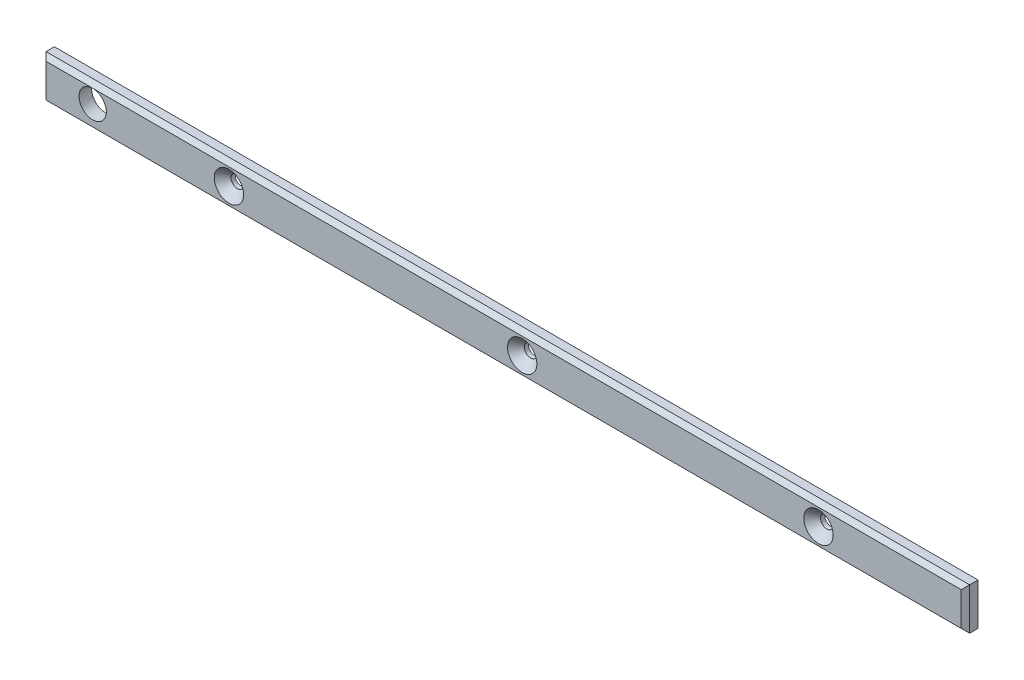
ISO-10303-21;
HEADER;
FILE_DESCRIPTION(('STEP AP214'),'2;1');
FILE_NAME('part.step','',(''),(''),'','','');
FILE_SCHEMA(('AUTOMOTIVE_DESIGN { 1 0 10303 214 1 1 1 1 }'));
ENDSEC;
DATA;
#1=APPLICATION_CONTEXT('core data for automotive mechanical design processes');
#2=APPLICATION_PROTOCOL_DEFINITION('international standard','automotive_design',2000,#1);
#3=PRODUCT_CONTEXT('',#1,'mechanical');
#4=PRODUCT('Part','Part','',(#3));
#5=PRODUCT_RELATED_PRODUCT_CATEGORY('part','',(#4));
#6=PRODUCT_DEFINITION_FORMATION('','',#4);
#7=PRODUCT_DEFINITION_CONTEXT('part definition',#1,'design');
#8=PRODUCT_DEFINITION('design','',#6,#7);
#9=PRODUCT_DEFINITION_SHAPE('','',#8);
#10=(LENGTH_UNIT() NAMED_UNIT(*) SI_UNIT(.MILLI.,.METRE.));
#11=(NAMED_UNIT(*) PLANE_ANGLE_UNIT() SI_UNIT($,.RADIAN.));
#12=(NAMED_UNIT(*) SI_UNIT($,.STERADIAN.) SOLID_ANGLE_UNIT());
#13=UNCERTAINTY_MEASURE_WITH_UNIT(LENGTH_MEASURE(1.E-05),#10,'distance_accuracy_value','');
#14=(GEOMETRIC_REPRESENTATION_CONTEXT(3) GLOBAL_UNCERTAINTY_ASSIGNED_CONTEXT((#13)) GLOBAL_UNIT_ASSIGNED_CONTEXT((#10,
#11,#12)) REPRESENTATION_CONTEXT('',''));
#15=CARTESIAN_POINT('',(0.,0.,0.));
#16=DIRECTION('',(0.,0.,1.));
#17=DIRECTION('',(1.,0.,0.));
#18=AXIS2_PLACEMENT_3D('',#15,#16,#17);
#19=CARTESIAN_POINT('',(-180.13682376559,-11.4814529840953,0.));
#20=DIRECTION('',(-1.,0.,0.));
#21=DIRECTION('',(0.,0.,1.));
#22=AXIS2_PLACEMENT_3D('',#19,#20,#21);
#23=PLANE('',#22);
#24=DIRECTION('',(0.,-1.,0.));
#25=VECTOR('',#24,1.);
#26=CARTESIAN_POINT('',(-180.13682376559,-11.4814529840953,2.));
#27=LINE('',#26,#25);
#28=CARTESIAN_POINT('',(-180.13682376559,-11.4814529840953,2.));
#29=VERTEX_POINT('',#28);
#30=CARTESIAN_POINT('',(-180.13682376559,-21.4814529840953,2.));
#31=VERTEX_POINT('',#30);
#32=EDGE_CURVE('E88',#29,#31,#27,.T.);
#33=ORIENTED_EDGE('',*,*,#32,.F.);
#34=DIRECTION('',(0.,0.,1.));
#35=VECTOR('',#34,1.);
#36=CARTESIAN_POINT('',(-180.13682376559,-11.4814529840953,0.));
#37=LINE('',#36,#35);
#38=CARTESIAN_POINT('',(-180.13682376559,-11.4814529840953,0.));
#39=VERTEX_POINT('',#38);
#40=EDGE_CURVE('E83',#39,#29,#37,.T.);
#41=ORIENTED_EDGE('',*,*,#40,.F.);
#42=DIRECTION('',(0.,-1.,0.));
#43=VECTOR('',#42,1.);
#44=CARTESIAN_POINT('',(-180.13682376559,-11.4814529840953,0.));
#45=LINE('',#44,#43);
#46=CARTESIAN_POINT('',(-180.13682376559,-21.4814529840953,0.));
#47=VERTEX_POINT('',#46);
#48=EDGE_CURVE('E85',#39,#47,#45,.T.);
#49=ORIENTED_EDGE('',*,*,#48,.T.);
#50=DIRECTION('',(0.,0.,1.));
#51=VECTOR('',#50,1.);
#52=CARTESIAN_POINT('',(-180.13682376559,-21.4814529840953,0.));
#53=LINE('',#52,#51);
#54=EDGE_CURVE('E11',#47,#31,#53,.T.);
#55=ORIENTED_EDGE('',*,*,#54,.T.);
#56=EDGE_LOOP('',(#33,#41,#49,#55));
#57=FACE_BOUND('',#56,.T.);
#58=ADVANCED_FACE('F17',(#57),#23,.T.);
#59=CARTESIAN_POINT('',(-180.13682376559,-21.4814529840953,0.));
#60=DIRECTION('',(0.,-1.,0.));
#61=DIRECTION('',(-1.,0.,0.));
#62=AXIS2_PLACEMENT_3D('',#59,#60,#61);
#63=PLANE('',#62);
#64=DIRECTION('',(1.,0.,0.));
#65=VECTOR('',#64,1.);
#66=CARTESIAN_POINT('',(-180.13682376559,-21.4814529840953,2.));
#67=LINE('',#66,#65);
#68=CARTESIAN_POINT('',(39.8631762344104,-21.4814529840953,2.));
#69=VERTEX_POINT('',#68);
#70=EDGE_CURVE('E148',#31,#69,#67,.T.);
#71=ORIENTED_EDGE('',*,*,#70,.F.);
#72=ORIENTED_EDGE('',*,*,#54,.F.);
#73=DIRECTION('',(1.,0.,0.));
#74=VECTOR('',#73,1.);
#75=CARTESIAN_POINT('',(-180.13682376559,-21.4814529840953,0.));
#76=LINE('',#75,#74);
#77=CARTESIAN_POINT('',(39.8631762344104,-21.4814529840953,0.));
#78=VERTEX_POINT('',#77);
#79=EDGE_CURVE('E100',#47,#78,#76,.T.);
#80=ORIENTED_EDGE('',*,*,#79,.T.);
#81=DIRECTION('',(0.,0.,1.));
#82=VECTOR('',#81,1.);
#83=CARTESIAN_POINT('',(39.8631762344104,-21.4814529840953,0.));
#84=LINE('',#83,#82);
#85=EDGE_CURVE('E25',#78,#69,#84,.T.);
#86=ORIENTED_EDGE('',*,*,#85,.T.);
#87=EDGE_LOOP('',(#71,#72,#80,#86));
#88=FACE_BOUND('',#87,.T.);
#89=ADVANCED_FACE('F211',(#88),#63,.T.);
#90=CARTESIAN_POINT('',(39.8631762344104,-21.4814529840953,0.));
#91=DIRECTION('',(1.,0.,0.));
#92=DIRECTION('',(0.,-1.,0.));
#93=AXIS2_PLACEMENT_3D('',#90,#91,#92);
#94=PLANE('',#93);
#95=DIRECTION('',(0.,1.,0.));
#96=VECTOR('',#95,1.);
#97=CARTESIAN_POINT('',(39.8631762344104,-21.4814529840953,2.));
#98=LINE('',#97,#96);
#99=CARTESIAN_POINT('',(39.8631762344104,-11.4814529840953,2.));
#100=VERTEX_POINT('',#99);
#101=EDGE_CURVE('E155',#69,#100,#98,.T.);
#102=ORIENTED_EDGE('',*,*,#101,.F.);
#103=ORIENTED_EDGE('',*,*,#85,.F.);
#104=DIRECTION('',(0.,1.,0.));
#105=VECTOR('',#104,1.);
#106=CARTESIAN_POINT('',(39.8631762344104,-21.4814529840953,0.));
#107=LINE('',#106,#105);
#108=CARTESIAN_POINT('',(39.8631762344104,-11.4814529840953,0.));
#109=VERTEX_POINT('',#108);
#110=EDGE_CURVE('E107',#78,#109,#107,.T.);
#111=ORIENTED_EDGE('',*,*,#110,.T.);
#112=DIRECTION('',(0.,0.,1.));
#113=VECTOR('',#112,1.);
#114=CARTESIAN_POINT('',(39.8631762344104,-11.4814529840953,0.));
#115=LINE('',#114,#113);
#116=EDGE_CURVE('E94',#109,#100,#115,.T.);
#117=ORIENTED_EDGE('',*,*,#116,.T.);
#118=EDGE_LOOP('',(#102,#103,#111,#117));
#119=FACE_BOUND('',#118,.T.);
#120=ADVANCED_FACE('F165',(#119),#94,.T.);
#121=CARTESIAN_POINT('',(39.8631762344104,-11.4814529840953,0.));
#122=DIRECTION('',(0.,1.,0.));
#123=DIRECTION('',(1.,0.,0.));
#124=AXIS2_PLACEMENT_3D('',#121,#122,#123);
#125=PLANE('',#124);
#126=DIRECTION('',(-1.,0.,0.));
#127=VECTOR('',#126,1.);
#128=CARTESIAN_POINT('',(39.8631762344104,-11.4814529840953,2.));
#129=LINE('',#128,#127);
#130=EDGE_CURVE('E133',#100,#29,#129,.T.);
#131=ORIENTED_EDGE('',*,*,#130,.F.);
#132=ORIENTED_EDGE('',*,*,#116,.F.);
#133=DIRECTION('',(-1.,0.,0.));
#134=VECTOR('',#133,1.);
#135=CARTESIAN_POINT('',(39.8631762344104,-11.4814529840953,0.));
#136=LINE('',#135,#134);
#137=EDGE_CURVE('E99',#109,#39,#136,.T.);
#138=ORIENTED_EDGE('',*,*,#137,.T.);
#139=ORIENTED_EDGE('',*,*,#40,.T.);
#140=EDGE_LOOP('',(#131,#132,#138,#139));
#141=FACE_BOUND('',#140,.T.);
#142=ADVANCED_FACE('F104',(#141),#125,.T.);
#143=CARTESIAN_POINT('',(39.8631762344104,-25.4814529840953,2.));
#144=DIRECTION('',(0.707106781186548,0.,0.707106781186548));
#145=DIRECTION('',(0.,-1.,0.));
#146=AXIS2_PLACEMENT_3D('',#143,#144,#145);
#147=PLANE('',#146);
#148=ORIENTED_EDGE('',*,*,#101,.T.);
#149=DIRECTION('',(-0.577350269189625,-0.577350269189625,0.577350269189628));
#150=VECTOR('',#149,1.);
#151=CARTESIAN_POINT('',(39.8631762344104,-11.4814529840953,2.));
#152=LINE('',#151,#150);
#153=CARTESIAN_POINT('',(38.8631762344104,-12.4814529840953,3.));
#154=VERTEX_POINT('',#153);
#155=EDGE_CURVE('E140',#100,#154,#152,.T.);
#156=ORIENTED_EDGE('',*,*,#155,.T.);
#157=DIRECTION('',(0.,1.,0.));
#158=VECTOR('',#157,1.);
#159=CARTESIAN_POINT('',(38.8631762344104,-20.4814529840953,3.));
#160=LINE('',#159,#158);
#161=CARTESIAN_POINT('',(38.8631762344104,-20.4814529840953,3.));
#162=VERTEX_POINT('',#161);
#163=EDGE_CURVE('E117',#162,#154,#160,.T.);
#164=ORIENTED_EDGE('',*,*,#163,.F.);
#165=DIRECTION('',(-0.577350269189625,0.577350269189629,0.577350269189623));
#166=VECTOR('',#165,1.);
#167=CARTESIAN_POINT('',(39.8631762344104,-21.4814529840953,2.));
#168=LINE('',#167,#166);
#169=EDGE_CURVE('E152',#69,#162,#168,.T.);
#170=ORIENTED_EDGE('',*,*,#169,.F.);
#171=EDGE_LOOP('',(#148,#156,#164,#170));
#172=FACE_BOUND('',#171,.T.);
#173=ADVANCED_FACE('F169',(#172),#147,.T.);
#174=CARTESIAN_POINT('',(-184.13682376559,-21.4814529840953,2.));
#175=DIRECTION('',(0.,-0.707106781186546,0.707106781186549));
#176=DIRECTION('',(-1.,0.,0.));
#177=AXIS2_PLACEMENT_3D('',#174,#175,#176);
#178=PLANE('',#177);
#179=ORIENTED_EDGE('',*,*,#70,.T.);
#180=ORIENTED_EDGE('',*,*,#169,.T.);
#181=DIRECTION('',(1.,0.,0.));
#182=VECTOR('',#181,1.);
#183=CARTESIAN_POINT('',(-179.13682376559,-20.4814529840953,3.));
#184=LINE('',#183,#182);
#185=CARTESIAN_POINT('',(-179.13682376559,-20.4814529840953,3.));
#186=VERTEX_POINT('',#185);
#187=EDGE_CURVE('E188',#186,#162,#184,.T.);
#188=ORIENTED_EDGE('',*,*,#187,.F.);
#189=DIRECTION('',(0.577350269189614,0.577350269189634,0.577350269189629));
#190=VECTOR('',#189,1.);
#191=CARTESIAN_POINT('',(-180.13682376559,-21.4814529840953,2.));
#192=LINE('',#191,#190);
#193=EDGE_CURVE('E145',#31,#186,#192,.T.);
#194=ORIENTED_EDGE('',*,*,#193,.F.);
#195=EDGE_LOOP('',(#179,#180,#188,#194));
#196=FACE_BOUND('',#195,.T.);
#197=ADVANCED_FACE('F214',(#196),#178,.T.);
#198=CARTESIAN_POINT('',(-180.13682376559,-7.48145298409528,2.));
#199=DIRECTION('',(-0.707106781186548,0.,0.707106781186548));
#200=DIRECTION('',(0.,1.,0.));
#201=AXIS2_PLACEMENT_3D('',#198,#199,#200);
#202=PLANE('',#201);
#203=ORIENTED_EDGE('',*,*,#32,.T.);
#204=ORIENTED_EDGE('',*,*,#193,.T.);
#205=DIRECTION('',(0.,-1.,0.));
#206=VECTOR('',#205,1.);
#207=CARTESIAN_POINT('',(-179.13682376559,-12.4814529840953,3.));
#208=LINE('',#207,#206);
#209=CARTESIAN_POINT('',(-179.13682376559,-12.4814529840953,3.));
#210=VERTEX_POINT('',#209);
#211=EDGE_CURVE('E181',#210,#186,#208,.T.);
#212=ORIENTED_EDGE('',*,*,#211,.F.);
#213=DIRECTION('',(0.577350269189626,-0.577350269189626,0.577350269189626));
#214=VECTOR('',#213,1.);
#215=CARTESIAN_POINT('',(-180.13682376559,-11.4814529840953,2.));
#216=LINE('',#215,#214);
#217=EDGE_CURVE('E137',#29,#210,#216,.T.);
#218=ORIENTED_EDGE('',*,*,#217,.F.);
#219=EDGE_LOOP('',(#203,#204,#212,#218));
#220=FACE_BOUND('',#219,.T.);
#221=ADVANCED_FACE('F216',(#220),#202,.T.);
#222=CARTESIAN_POINT('',(43.8631762344104,-11.4814529840953,2.));
#223=DIRECTION('',(0.,0.707106781186548,0.707106781186547));
#224=DIRECTION('',(1.,0.,0.));
#225=AXIS2_PLACEMENT_3D('',#222,#223,#224);
#226=PLANE('',#225);
#227=ORIENTED_EDGE('',*,*,#130,.T.);
#228=ORIENTED_EDGE('',*,*,#217,.T.);
#229=DIRECTION('',(-1.,0.,0.));
#230=VECTOR('',#229,1.);
#231=CARTESIAN_POINT('',(38.8631762344104,-12.4814529840953,3.));
#232=LINE('',#231,#230);
#233=EDGE_CURVE('E176',#154,#210,#232,.T.);
#234=ORIENTED_EDGE('',*,*,#233,.F.);
#235=ORIENTED_EDGE('',*,*,#155,.F.);
#236=EDGE_LOOP('',(#227,#228,#234,#235));
#237=FACE_BOUND('',#236,.T.);
#238=ADVANCED_FACE('F174',(#237),#226,.T.);
#239=CARTESIAN_POINT('',(-168.016835100665,-15.7589721414259,-3.5));
#240=DIRECTION('',(0.,0.,1.));
#241=DIRECTION('',(-1.,0.,0.));
#242=AXIS2_PLACEMENT_3D('',#239,#240,#241);
#243=CYLINDRICAL_SURFACE('',#242,3.25);
#244=CARTESIAN_POINT('',(-168.016835100665,-15.7589721414259,3.));
#245=DIRECTION('',(0.,0.,-1.));
#246=DIRECTION('',(-1.,0.,0.));
#247=AXIS2_PLACEMENT_3D('',#244,#245,#246);
#248=CIRCLE('',#247,3.25);
#249=CARTESIAN_POINT('',(-171.266835100665,-15.7589721414259,3.));
#250=VERTEX_POINT('',#249);
#251=EDGE_CURVE('E108',#250,#250,#248,.T.);
#252=ORIENTED_EDGE('',*,*,#251,.F.);
#253=EDGE_LOOP('',(#252));
#254=FACE_BOUND('',#253,.T.);
#255=CARTESIAN_POINT('',(-168.016835100665,-15.7589721414259,0.));
#256=DIRECTION('',(0.,0.,1.));
#257=DIRECTION('',(-1.,0.,0.));
#258=AXIS2_PLACEMENT_3D('',#255,#256,#257);
#259=CIRCLE('',#258,3.25);
#260=CARTESIAN_POINT('',(-171.266835100665,-15.7589721414259,0.));
#261=VERTEX_POINT('',#260);
#262=EDGE_CURVE('E102',#261,#261,#259,.T.);
#263=ORIENTED_EDGE('',*,*,#262,.F.);
#264=EDGE_LOOP('',(#263));
#265=FACE_BOUND('',#264,.T.);
#266=ADVANCED_FACE('F250',(#254,#265),#243,.F.);
#267=CARTESIAN_POINT('',(4.86317623441042,-16.4814529840953,-3.5));
#268=DIRECTION('',(0.,0.,1.));
#269=DIRECTION('',(-1.,0.,0.));
#270=AXIS2_PLACEMENT_3D('',#267,#268,#269);
#271=CYLINDRICAL_SURFACE('',#270,1.5);
#272=CARTESIAN_POINT('',(4.86317623441042,-16.4814529840953,1.));
#273=DIRECTION('',(0.,0.,-1.));
#274=DIRECTION('',(-1.,0.,0.));
#275=AXIS2_PLACEMENT_3D('',#272,#273,#274);
#276=CIRCLE('',#275,1.5);
#277=CARTESIAN_POINT('',(3.36317623441042,-16.4814529840953,1.));
#278=VERTEX_POINT('',#277);
#279=EDGE_CURVE('E481',#278,#278,#276,.T.);
#280=ORIENTED_EDGE('',*,*,#279,.F.);
#281=EDGE_LOOP('',(#280));
#282=FACE_BOUND('',#281,.T.);
#283=CARTESIAN_POINT('',(4.86317623441042,-16.4814529840953,0.));
#284=DIRECTION('',(0.,0.,1.));
#285=DIRECTION('',(-1.,0.,0.));
#286=AXIS2_PLACEMENT_3D('',#283,#284,#285);
#287=CIRCLE('',#286,1.5);
#288=CARTESIAN_POINT('',(3.36317623441042,-16.4814529840953,0.));
#289=VERTEX_POINT('',#288);
#290=EDGE_CURVE('E121',#289,#289,#287,.T.);
#291=ORIENTED_EDGE('',*,*,#290,.F.);
#292=EDGE_LOOP('',(#291));
#293=FACE_BOUND('',#292,.T.);
#294=ADVANCED_FACE('F246',(#282,#293),#271,.F.);
#295=CARTESIAN_POINT('',(-135.558215827549,-16.4814529840953,-3.5));
#296=DIRECTION('',(0.,0.,1.));
#297=DIRECTION('',(-1.,0.,0.));
#298=AXIS2_PLACEMENT_3D('',#295,#296,#297);
#299=CYLINDRICAL_SURFACE('',#298,1.5);
#300=CARTESIAN_POINT('',(-135.558215827549,-16.4814529840953,1.));
#301=DIRECTION('',(0.,0.,-1.));
#302=DIRECTION('',(-1.,0.,0.));
#303=AXIS2_PLACEMENT_3D('',#300,#301,#302);
#304=CIRCLE('',#303,1.5);
#305=CARTESIAN_POINT('',(-137.058215827549,-16.4814529840953,1.));
#306=VERTEX_POINT('',#305);
#307=EDGE_CURVE('E204',#306,#306,#304,.T.);
#308=ORIENTED_EDGE('',*,*,#307,.F.);
#309=EDGE_LOOP('',(#308));
#310=FACE_BOUND('',#309,.T.);
#311=CARTESIAN_POINT('',(-135.558215827549,-16.4814529840953,0.));
#312=DIRECTION('',(0.,0.,1.));
#313=DIRECTION('',(-1.,0.,0.));
#314=AXIS2_PLACEMENT_3D('',#311,#312,#313);
#315=CIRCLE('',#314,1.5);
#316=CARTESIAN_POINT('',(-137.058215827549,-16.4814529840953,0.));
#317=VERTEX_POINT('',#316);
#318=EDGE_CURVE('E125',#317,#317,#315,.T.);
#319=ORIENTED_EDGE('',*,*,#318,.F.);
#320=EDGE_LOOP('',(#319));
#321=FACE_BOUND('',#320,.T.);
#322=ADVANCED_FACE('F249',(#310,#321),#299,.F.);
#323=CARTESIAN_POINT('',(-65.7078902411199,-16.4814529840953,-3.5));
#324=DIRECTION('',(0.,0.,1.));
#325=DIRECTION('',(-1.,0.,0.));
#326=AXIS2_PLACEMENT_3D('',#323,#324,#325);
#327=CYLINDRICAL_SURFACE('',#326,1.5);
#328=CARTESIAN_POINT('',(-65.7078902411199,-16.4814529840953,1.));
#329=DIRECTION('',(0.,0.,-1.));
#330=DIRECTION('',(-1.,0.,0.));
#331=AXIS2_PLACEMENT_3D('',#328,#329,#330);
#332=CIRCLE('',#331,1.5);
#333=CARTESIAN_POINT('',(-67.2078902411199,-16.4814529840953,1.));
#334=VERTEX_POINT('',#333);
#335=EDGE_CURVE('E182',#334,#334,#332,.T.);
#336=ORIENTED_EDGE('',*,*,#335,.F.);
#337=EDGE_LOOP('',(#336));
#338=FACE_BOUND('',#337,.T.);
#339=CARTESIAN_POINT('',(-65.7078902411199,-16.4814529840953,0.));
#340=DIRECTION('',(0.,0.,1.));
#341=DIRECTION('',(-1.,0.,0.));
#342=AXIS2_PLACEMENT_3D('',#339,#340,#341);
#343=CIRCLE('',#342,1.5);
#344=CARTESIAN_POINT('',(-67.2078902411199,-16.4814529840953,0.));
#345=VERTEX_POINT('',#344);
#346=EDGE_CURVE('E129',#345,#345,#343,.T.);
#347=ORIENTED_EDGE('',*,*,#346,.F.);
#348=EDGE_LOOP('',(#347));
#349=FACE_BOUND('',#348,.T.);
#350=ADVANCED_FACE('F230',(#338,#349),#327,.F.);
#351=CARTESIAN_POINT('',(0.,0.,0.));
#352=DIRECTION('',(0.,0.,1.));
#353=DIRECTION('',(1.,0.,0.));
#354=AXIS2_PLACEMENT_3D('',#351,#352,#353);
#355=PLANE('',#354);
#356=ORIENTED_EDGE('',*,*,#346,.T.);
#357=EDGE_LOOP('',(#356));
#358=FACE_BOUND('',#357,.T.);
#359=ORIENTED_EDGE('',*,*,#318,.T.);
#360=EDGE_LOOP('',(#359));
#361=FACE_BOUND('',#360,.T.);
#362=ORIENTED_EDGE('',*,*,#290,.T.);
#363=EDGE_LOOP('',(#362));
#364=FACE_BOUND('',#363,.T.);
#365=ORIENTED_EDGE('',*,*,#262,.T.);
#366=EDGE_LOOP('',(#365));
#367=FACE_BOUND('',#366,.T.);
#368=ORIENTED_EDGE('',*,*,#137,.F.);
#369=ORIENTED_EDGE('',*,*,#110,.F.);
#370=ORIENTED_EDGE('',*,*,#79,.F.);
#371=ORIENTED_EDGE('',*,*,#48,.F.);
#372=EDGE_LOOP('',(#368,#369,#370,#371));
#373=FACE_BOUND('',#372,.T.);
#374=ADVANCED_FACE('F97',(#358,#361,#364,#367,#373),#355,.F.);
#375=CARTESIAN_POINT('',(0.,0.,3.));
#376=DIRECTION('',(0.,0.,1.));
#377=DIRECTION('',(1.,0.,0.));
#378=AXIS2_PLACEMENT_3D('',#375,#376,#377);
#379=PLANE('',#378);
#380=CARTESIAN_POINT('',(4.86317623441042,-16.4814529840953,3.));
#381=DIRECTION('',(0.,0.,-1.));
#382=DIRECTION('',(-1.,0.,0.));
#383=AXIS2_PLACEMENT_3D('',#380,#381,#382);
#384=CIRCLE('',#383,3.5);
#385=CARTESIAN_POINT('',(1.36317623441042,-16.4814529840953,3.));
#386=VERTEX_POINT('',#385);
#387=EDGE_CURVE('E488',#386,#386,#384,.T.);
#388=ORIENTED_EDGE('',*,*,#387,.T.);
#389=EDGE_LOOP('',(#388));
#390=FACE_BOUND('',#389,.T.);
#391=CARTESIAN_POINT('',(-135.558215827549,-16.4814529840953,3.));
#392=DIRECTION('',(0.,0.,-1.));
#393=DIRECTION('',(-1.,0.,0.));
#394=AXIS2_PLACEMENT_3D('',#391,#392,#393);
#395=CIRCLE('',#394,3.5);
#396=CARTESIAN_POINT('',(-139.058215827549,-16.4814529840953,3.));
#397=VERTEX_POINT('',#396);
#398=EDGE_CURVE('E472',#397,#397,#395,.T.);
#399=ORIENTED_EDGE('',*,*,#398,.T.);
#400=EDGE_LOOP('',(#399));
#401=FACE_BOUND('',#400,.T.);
#402=CARTESIAN_POINT('',(-65.7078902411199,-16.4814529840953,3.));
#403=DIRECTION('',(0.,0.,-1.));
#404=DIRECTION('',(-1.,0.,0.));
#405=AXIS2_PLACEMENT_3D('',#402,#403,#404);
#406=CIRCLE('',#405,3.5);
#407=CARTESIAN_POINT('',(-69.2078902411199,-16.4814529840953,3.));
#408=VERTEX_POINT('',#407);
#409=EDGE_CURVE('E191',#408,#408,#406,.T.);
#410=ORIENTED_EDGE('',*,*,#409,.T.);
#411=EDGE_LOOP('',(#410));
#412=FACE_BOUND('',#411,.T.);
#413=ORIENTED_EDGE('',*,*,#251,.T.);
#414=EDGE_LOOP('',(#413));
#415=FACE_BOUND('',#414,.T.);
#416=ORIENTED_EDGE('',*,*,#233,.T.);
#417=ORIENTED_EDGE('',*,*,#211,.T.);
#418=ORIENTED_EDGE('',*,*,#187,.T.);
#419=ORIENTED_EDGE('',*,*,#163,.T.);
#420=EDGE_LOOP('',(#416,#417,#418,#419));
#421=FACE_BOUND('',#420,.T.);
#422=ADVANCED_FACE('F217',(#390,#401,#412,#415,#421),#379,.T.);
#423=CARTESIAN_POINT('',(-65.7078902411199,-16.4814529840953,2.));
#424=DIRECTION('',(0.,0.,1.));
#425=DIRECTION('',(-1.,0.,0.));
#426=AXIS2_PLACEMENT_3D('',#423,#424,#425);
#427=CONICAL_SURFACE('',#426,2.5,0.785398163397448);
#428=ORIENTED_EDGE('',*,*,#335,.T.);
#429=EDGE_LOOP('',(#428));
#430=FACE_BOUND('',#429,.T.);
#431=ORIENTED_EDGE('',*,*,#409,.F.);
#432=EDGE_LOOP('',(#431));
#433=FACE_BOUND('',#432,.T.);
#434=ADVANCED_FACE('F219',(#430,#433),#427,.F.);
#435=CARTESIAN_POINT('',(-135.558215827549,-16.4814529840953,2.));
#436=DIRECTION('',(0.,0.,1.));
#437=DIRECTION('',(-1.,0.,0.));
#438=AXIS2_PLACEMENT_3D('',#435,#436,#437);
#439=CONICAL_SURFACE('',#438,2.5,0.785398163397448);
#440=ORIENTED_EDGE('',*,*,#307,.T.);
#441=EDGE_LOOP('',(#440));
#442=FACE_BOUND('',#441,.T.);
#443=ORIENTED_EDGE('',*,*,#398,.F.);
#444=EDGE_LOOP('',(#443));
#445=FACE_BOUND('',#444,.T.);
#446=ADVANCED_FACE('F227',(#442,#445),#439,.F.);
#447=CARTESIAN_POINT('',(4.86317623441042,-16.4814529840953,2.));
#448=DIRECTION('',(0.,0.,1.));
#449=DIRECTION('',(-1.,0.,0.));
#450=AXIS2_PLACEMENT_3D('',#447,#448,#449);
#451=CONICAL_SURFACE('',#450,2.5,0.785398163397448);
#452=ORIENTED_EDGE('',*,*,#279,.T.);
#453=EDGE_LOOP('',(#452));
#454=FACE_BOUND('',#453,.T.);
#455=ORIENTED_EDGE('',*,*,#387,.F.);
#456=EDGE_LOOP('',(#455));
#457=FACE_BOUND('',#456,.T.);
#458=ADVANCED_FACE('F341',(#454,#457),#451,.F.);
#459=CLOSED_SHELL('',(#58,#89,#120,#142,#173,#197,#221,#238,#266,#294,#322,#350,#374,#422,#434,
#446,#458));
#460=MANIFOLD_SOLID_BREP('B1',#459);
#461=ADVANCED_BREP_SHAPE_REPRESENTATION('',(#18,#460),#14);
#462=SHAPE_DEFINITION_REPRESENTATION(#9,#461);
ENDSEC;
END-ISO-10303-21;
